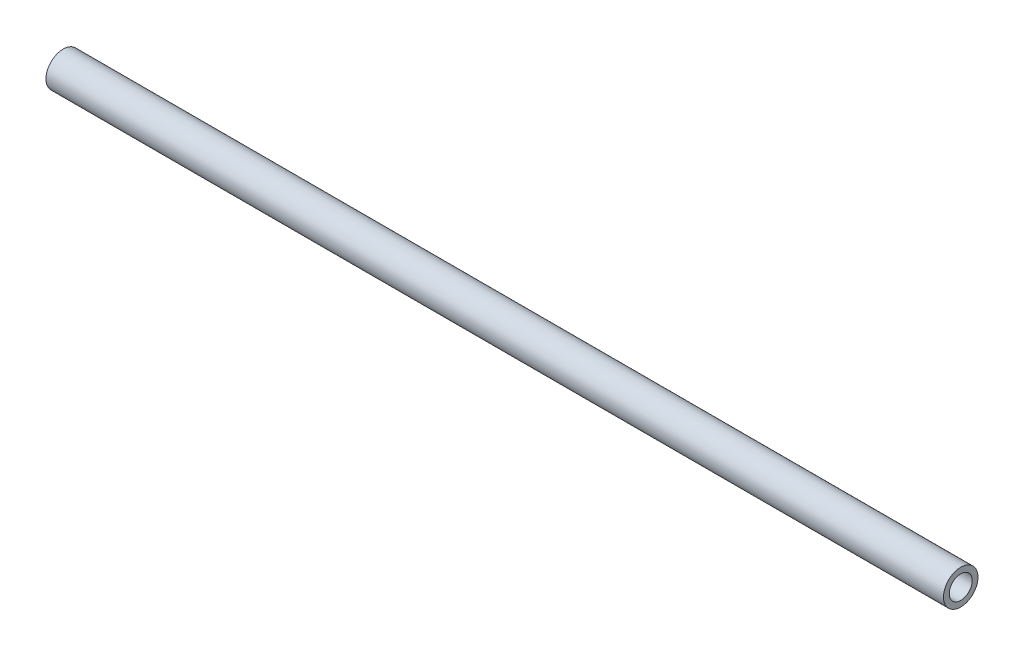
ISO-10303-21;
HEADER;
FILE_DESCRIPTION(('STEP AP214'),'2;1');
FILE_NAME('part.step','',(''),(''),'','','');
FILE_SCHEMA(('AUTOMOTIVE_DESIGN { 1 0 10303 214 1 1 1 1 }'));
ENDSEC;
DATA;
#1=APPLICATION_CONTEXT('core data for automotive mechanical design processes');
#2=APPLICATION_PROTOCOL_DEFINITION('international standard','automotive_design',2000,#1);
#3=PRODUCT_CONTEXT('',#1,'mechanical');
#4=PRODUCT('Part','Part','',(#3));
#5=PRODUCT_RELATED_PRODUCT_CATEGORY('part','',(#4));
#6=PRODUCT_DEFINITION_FORMATION('','',#4);
#7=PRODUCT_DEFINITION_CONTEXT('part definition',#1,'design');
#8=PRODUCT_DEFINITION('design','',#6,#7);
#9=PRODUCT_DEFINITION_SHAPE('','',#8);
#10=(LENGTH_UNIT() NAMED_UNIT(*) SI_UNIT(.MILLI.,.METRE.));
#11=(NAMED_UNIT(*) PLANE_ANGLE_UNIT() SI_UNIT($,.RADIAN.));
#12=(NAMED_UNIT(*) SI_UNIT($,.STERADIAN.) SOLID_ANGLE_UNIT());
#13=UNCERTAINTY_MEASURE_WITH_UNIT(LENGTH_MEASURE(1.E-05),#10,'distance_accuracy_value','');
#14=(GEOMETRIC_REPRESENTATION_CONTEXT(3) GLOBAL_UNCERTAINTY_ASSIGNED_CONTEXT((#13)) GLOBAL_UNIT_ASSIGNED_CONTEXT((#10,
#11,#12)) REPRESENTATION_CONTEXT('',''));
#15=CARTESIAN_POINT('',(0.,0.,0.));
#16=DIRECTION('',(0.,0.,1.));
#17=DIRECTION('',(1.,0.,0.));
#18=AXIS2_PLACEMENT_3D('',#15,#16,#17);
#19=CARTESIAN_POINT('',(-495.3,0.,0.));
#20=DIRECTION('',(1.,0.,0.));
#21=DIRECTION('',(0.,0.,-1.));
#22=AXIS2_PLACEMENT_3D('',#19,#20,#21);
#23=CYLINDRICAL_SURFACE('',#22,6.35);
#24=CARTESIAN_POINT('',(-495.3,0.,0.));
#25=DIRECTION('',(1.,0.,0.));
#26=DIRECTION('',(0.,0.,-1.));
#27=AXIS2_PLACEMENT_3D('',#24,#25,#26);
#28=CIRCLE('',#27,6.35);
#29=CARTESIAN_POINT('',(-495.3,0.,-6.35));
#30=VERTEX_POINT('',#29);
#31=EDGE_CURVE('E48',#30,#30,#28,.T.);
#32=ORIENTED_EDGE('',*,*,#31,.F.);
#33=EDGE_LOOP('',(#32));
#34=FACE_BOUND('',#33,.T.);
#35=CARTESIAN_POINT('',(0.,0.,0.));
#36=DIRECTION('',(1.,0.,0.));
#37=DIRECTION('',(0.,0.,-1.));
#38=AXIS2_PLACEMENT_3D('',#35,#36,#37);
#39=CIRCLE('',#38,6.35);
#40=CARTESIAN_POINT('',(0.,0.,-6.35));
#41=VERTEX_POINT('',#40);
#42=EDGE_CURVE('E54',#41,#41,#39,.T.);
#43=ORIENTED_EDGE('',*,*,#42,.T.);
#44=EDGE_LOOP('',(#43));
#45=FACE_BOUND('',#44,.T.);
#46=ADVANCED_FACE('F41',(#34,#45),#23,.F.);
#47=CARTESIAN_POINT('',(-495.3,0.,0.));
#48=DIRECTION('',(1.,0.,0.));
#49=DIRECTION('',(0.,0.,-1.));
#50=AXIS2_PLACEMENT_3D('',#47,#48,#49);
#51=CYLINDRICAL_SURFACE('',#50,9.525);
#52=CARTESIAN_POINT('',(-495.3,0.,0.));
#53=DIRECTION('',(1.,0.,0.));
#54=DIRECTION('',(0.,0.,-1.));
#55=AXIS2_PLACEMENT_3D('',#52,#53,#54);
#56=CIRCLE('',#55,9.525);
#57=CARTESIAN_POINT('',(-495.3,0.,-9.525));
#58=VERTEX_POINT('',#57);
#59=EDGE_CURVE('E10',#58,#58,#56,.T.);
#60=ORIENTED_EDGE('',*,*,#59,.T.);
#61=EDGE_LOOP('',(#60));
#62=FACE_BOUND('',#61,.T.);
#63=CARTESIAN_POINT('',(0.,0.,0.));
#64=DIRECTION('',(1.,0.,0.));
#65=DIRECTION('',(0.,0.,-1.));
#66=AXIS2_PLACEMENT_3D('',#63,#64,#65);
#67=CIRCLE('',#66,9.525);
#68=CARTESIAN_POINT('',(0.,0.,-9.525));
#69=VERTEX_POINT('',#68);
#70=EDGE_CURVE('E44',#69,#69,#67,.T.);
#71=ORIENTED_EDGE('',*,*,#70,.F.);
#72=EDGE_LOOP('',(#71));
#73=FACE_BOUND('',#72,.T.);
#74=ADVANCED_FACE('F63',(#62,#73),#51,.T.);
#75=CARTESIAN_POINT('',(-495.3,0.,0.));
#76=DIRECTION('',(1.,0.,0.));
#77=DIRECTION('',(0.,0.,-1.));
#78=AXIS2_PLACEMENT_3D('',#75,#76,#77);
#79=PLANE('',#78);
#80=ORIENTED_EDGE('',*,*,#31,.T.);
#81=EDGE_LOOP('',(#80));
#82=FACE_BOUND('',#81,.T.);
#83=ORIENTED_EDGE('',*,*,#59,.F.);
#84=EDGE_LOOP('',(#83));
#85=FACE_BOUND('',#84,.T.);
#86=ADVANCED_FACE('F65',(#82,#85),#79,.F.);
#87=CARTESIAN_POINT('',(0.,0.,0.));
#88=DIRECTION('',(1.,0.,0.));
#89=DIRECTION('',(0.,0.,-1.));
#90=AXIS2_PLACEMENT_3D('',#87,#88,#89);
#91=PLANE('',#90);
#92=ORIENTED_EDGE('',*,*,#42,.F.);
#93=EDGE_LOOP('',(#92));
#94=FACE_BOUND('',#93,.T.);
#95=ORIENTED_EDGE('',*,*,#70,.T.);
#96=EDGE_LOOP('',(#95));
#97=FACE_BOUND('',#96,.T.);
#98=ADVANCED_FACE('F61',(#94,#97),#91,.T.);
#99=CLOSED_SHELL('',(#46,#74,#86,#98));
#100=MANIFOLD_SOLID_BREP('B2',#99);
#101=ADVANCED_BREP_SHAPE_REPRESENTATION('',(#18,#100),#14);
#102=SHAPE_DEFINITION_REPRESENTATION(#9,#101);
ENDSEC;
END-ISO-10303-21;
